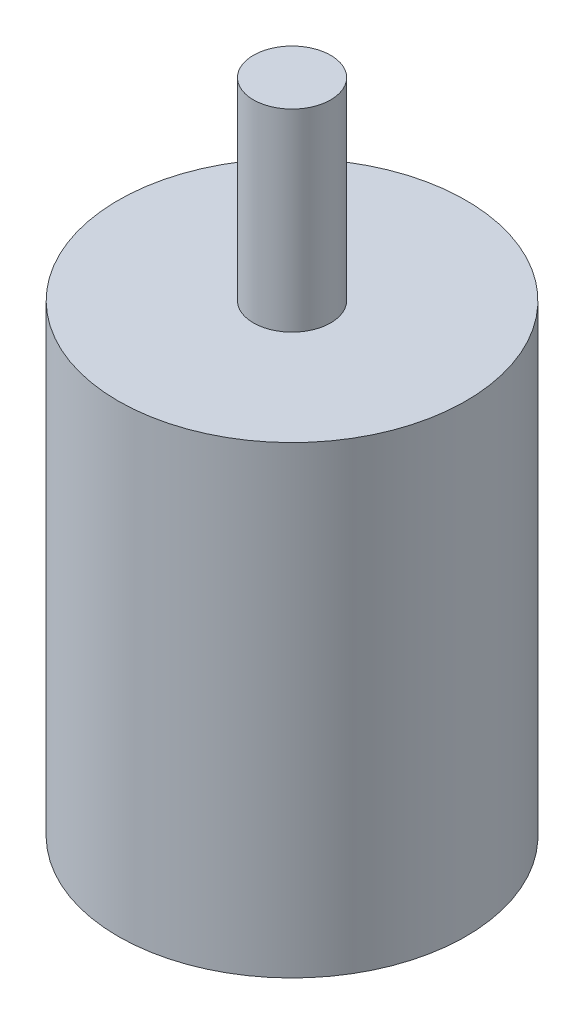
ISO-10303-21;
HEADER;
FILE_DESCRIPTION(('STEP AP214'),'2;1');
FILE_NAME('part.step','',(''),(''),'','','');
FILE_SCHEMA(('AUTOMOTIVE_DESIGN { 1 0 10303 214 1 1 1 1 }'));
ENDSEC;
DATA;
#1=APPLICATION_CONTEXT('core data for automotive mechanical design processes');
#2=APPLICATION_PROTOCOL_DEFINITION('international standard','automotive_design',2000,#1);
#3=PRODUCT_CONTEXT('',#1,'mechanical');
#4=PRODUCT('Part','Part','',(#3));
#5=PRODUCT_RELATED_PRODUCT_CATEGORY('part','',(#4));
#6=PRODUCT_DEFINITION_FORMATION('','',#4);
#7=PRODUCT_DEFINITION_CONTEXT('part definition',#1,'design');
#8=PRODUCT_DEFINITION('design','',#6,#7);
#9=PRODUCT_DEFINITION_SHAPE('','',#8);
#10=(LENGTH_UNIT() NAMED_UNIT(*) SI_UNIT(.MILLI.,.METRE.));
#11=(NAMED_UNIT(*) PLANE_ANGLE_UNIT() SI_UNIT($,.RADIAN.));
#12=(NAMED_UNIT(*) SI_UNIT($,.STERADIAN.) SOLID_ANGLE_UNIT());
#13=UNCERTAINTY_MEASURE_WITH_UNIT(LENGTH_MEASURE(1.E-05),#10,'distance_accuracy_value','');
#14=(GEOMETRIC_REPRESENTATION_CONTEXT(3) GLOBAL_UNCERTAINTY_ASSIGNED_CONTEXT((#13)) GLOBAL_UNIT_ASSIGNED_CONTEXT((#10,
#11,#12)) REPRESENTATION_CONTEXT('',''));
#15=CARTESIAN_POINT('',(0.,0.,0.));
#16=DIRECTION('',(0.,0.,1.));
#17=DIRECTION('',(1.,0.,0.));
#18=AXIS2_PLACEMENT_3D('',#15,#16,#17);
#19=CARTESIAN_POINT('',(0.,60.,0.));
#20=DIRECTION('',(0.,-1.,0.));
#21=DIRECTION('',(0.,0.,-1.));
#22=AXIS2_PLACEMENT_3D('',#19,#20,#21);
#23=CYLINDRICAL_SURFACE('',#22,22.5);
#24=CARTESIAN_POINT('',(0.,60.,0.));
#25=DIRECTION('',(0.,1.,0.));
#26=DIRECTION('',(0.,0.,1.));
#27=AXIS2_PLACEMENT_3D('',#24,#25,#26);
#28=CIRCLE('',#27,22.5);
#29=CARTESIAN_POINT('',(0.,60.,22.5));
#30=VERTEX_POINT('',#29);
#31=EDGE_CURVE('E10',#30,#30,#28,.T.);
#32=ORIENTED_EDGE('',*,*,#31,.F.);
#33=EDGE_LOOP('',(#32));
#34=FACE_BOUND('',#33,.T.);
#35=CARTESIAN_POINT('',(0.,0.,0.));
#36=DIRECTION('',(0.,1.,0.));
#37=DIRECTION('',(0.,0.,1.));
#38=AXIS2_PLACEMENT_3D('',#35,#36,#37);
#39=CIRCLE('',#38,22.5);
#40=CARTESIAN_POINT('',(0.,0.,22.5));
#41=VERTEX_POINT('',#40);
#42=EDGE_CURVE('E42',#41,#41,#39,.T.);
#43=ORIENTED_EDGE('',*,*,#42,.T.);
#44=EDGE_LOOP('',(#43));
#45=FACE_BOUND('',#44,.T.);
#46=ADVANCED_FACE('F39',(#34,#45),#23,.T.);
#47=CARTESIAN_POINT('',(0.,60.,0.));
#48=DIRECTION('',(0.,1.,0.));
#49=DIRECTION('',(0.,0.,1.));
#50=AXIS2_PLACEMENT_3D('',#47,#48,#49);
#51=PLANE('',#50);
#52=CARTESIAN_POINT('',(0.,60.,0.));
#53=DIRECTION('',(0.,1.,0.));
#54=DIRECTION('',(0.,0.,1.));
#55=AXIS2_PLACEMENT_3D('',#52,#53,#54);
#56=CIRCLE('',#55,5.);
#57=CARTESIAN_POINT('',(0.,60.,5.));
#58=VERTEX_POINT('',#57);
#59=EDGE_CURVE('E53',#58,#58,#56,.T.);
#60=ORIENTED_EDGE('',*,*,#59,.F.);
#61=EDGE_LOOP('',(#60));
#62=FACE_BOUND('',#61,.T.);
#63=ORIENTED_EDGE('',*,*,#31,.T.);
#64=EDGE_LOOP('',(#63));
#65=FACE_BOUND('',#64,.T.);
#66=ADVANCED_FACE('F70',(#62,#65),#51,.T.);
#67=CARTESIAN_POINT('',(0.,0.,0.));
#68=DIRECTION('',(0.,1.,0.));
#69=DIRECTION('',(0.,0.,1.));
#70=AXIS2_PLACEMENT_3D('',#67,#68,#69);
#71=PLANE('',#70);
#72=ORIENTED_EDGE('',*,*,#42,.F.);
#73=EDGE_LOOP('',(#72));
#74=FACE_BOUND('',#73,.T.);
#75=ADVANCED_FACE('F66',(#74),#71,.F.);
#76=CARTESIAN_POINT('',(0.,85.,0.));
#77=DIRECTION('',(0.,-1.,0.));
#78=DIRECTION('',(0.,0.,-1.));
#79=AXIS2_PLACEMENT_3D('',#76,#77,#78);
#80=CYLINDRICAL_SURFACE('',#79,5.);
#81=CARTESIAN_POINT('',(0.,85.,0.));
#82=DIRECTION('',(0.,1.,0.));
#83=DIRECTION('',(0.,0.,1.));
#84=AXIS2_PLACEMENT_3D('',#81,#82,#83);
#85=CIRCLE('',#84,5.);
#86=CARTESIAN_POINT('',(0.,85.,5.));
#87=VERTEX_POINT('',#86);
#88=EDGE_CURVE('E51',#87,#87,#85,.T.);
#89=ORIENTED_EDGE('',*,*,#88,.F.);
#90=EDGE_LOOP('',(#89));
#91=FACE_BOUND('',#90,.T.);
#92=ORIENTED_EDGE('',*,*,#59,.T.);
#93=EDGE_LOOP('',(#92));
#94=FACE_BOUND('',#93,.T.);
#95=ADVANCED_FACE('F63',(#91,#94),#80,.T.);
#96=CARTESIAN_POINT('',(0.,85.,0.));
#97=DIRECTION('',(0.,1.,0.));
#98=DIRECTION('',(0.,0.,1.));
#99=AXIS2_PLACEMENT_3D('',#96,#97,#98);
#100=PLANE('',#99);
#101=ORIENTED_EDGE('',*,*,#88,.T.);
#102=EDGE_LOOP('',(#101));
#103=FACE_BOUND('',#102,.T.);
#104=ADVANCED_FACE('F61',(#103),#100,.T.);
#105=CLOSED_SHELL('',(#46,#66,#75,#95,#104));
#106=MANIFOLD_SOLID_BREP('B2',#105);
#107=ADVANCED_BREP_SHAPE_REPRESENTATION('',(#18,#106),#14);
#108=SHAPE_DEFINITION_REPRESENTATION(#9,#107);
ENDSEC;
END-ISO-10303-21;
